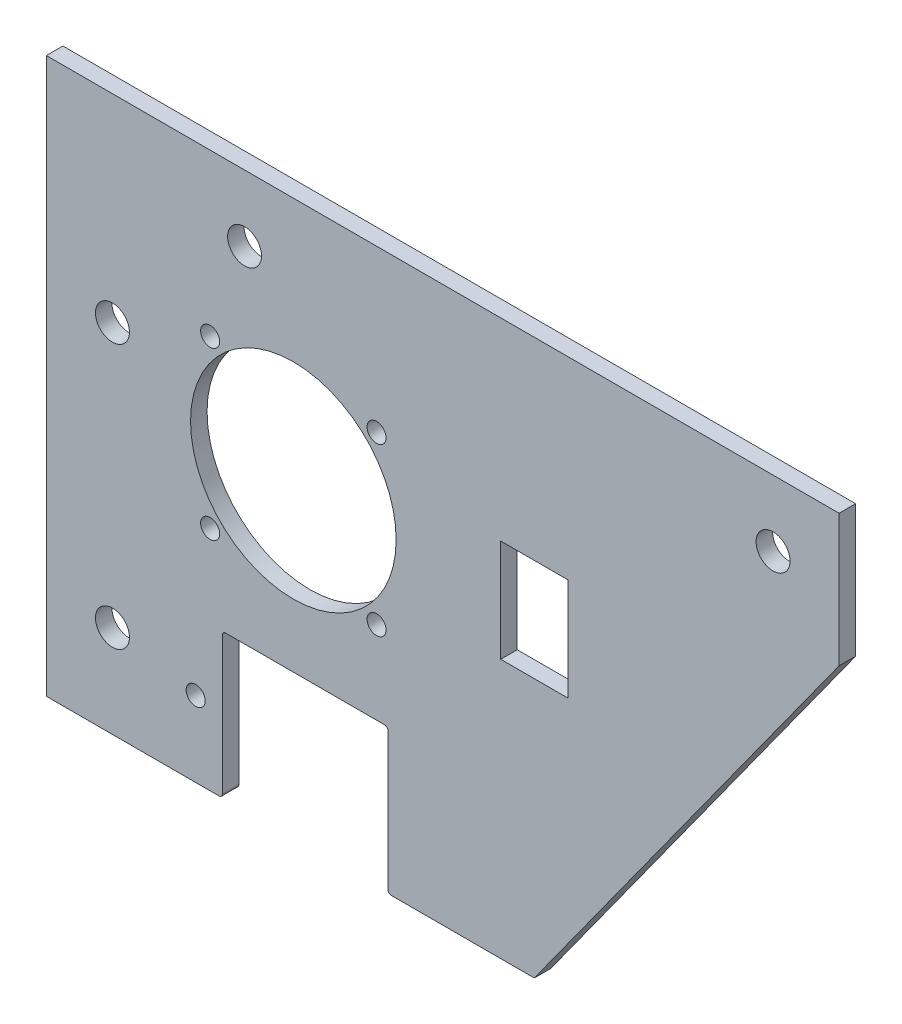
ISO-10303-21;
HEADER;
FILE_DESCRIPTION(('STEP AP214'),'2;1');
FILE_NAME('part.step','',(''),(''),'','','');
FILE_SCHEMA(('AUTOMOTIVE_DESIGN { 1 0 10303 214 1 1 1 1 }'));
ENDSEC;
DATA;
#1=APPLICATION_CONTEXT('core data for automotive mechanical design processes');
#2=APPLICATION_PROTOCOL_DEFINITION('international standard','automotive_design',2000,#1);
#3=PRODUCT_CONTEXT('',#1,'mechanical');
#4=PRODUCT('Part','Part','',(#3));
#5=PRODUCT_RELATED_PRODUCT_CATEGORY('part','',(#4));
#6=PRODUCT_DEFINITION_FORMATION('','',#4);
#7=PRODUCT_DEFINITION_CONTEXT('part definition',#1,'design');
#8=PRODUCT_DEFINITION('design','',#6,#7);
#9=PRODUCT_DEFINITION_SHAPE('','',#8);
#10=(LENGTH_UNIT() NAMED_UNIT(*) SI_UNIT(.MILLI.,.METRE.));
#11=(NAMED_UNIT(*) PLANE_ANGLE_UNIT() SI_UNIT($,.RADIAN.));
#12=(NAMED_UNIT(*) SI_UNIT($,.STERADIAN.) SOLID_ANGLE_UNIT());
#13=UNCERTAINTY_MEASURE_WITH_UNIT(LENGTH_MEASURE(1.E-05),#10,'distance_accuracy_value','');
#14=(GEOMETRIC_REPRESENTATION_CONTEXT(3) GLOBAL_UNCERTAINTY_ASSIGNED_CONTEXT((#13)) GLOBAL_UNIT_ASSIGNED_CONTEXT((#10,
#11,#12)) REPRESENTATION_CONTEXT('',''));
#15=CARTESIAN_POINT('',(0.,0.,0.));
#16=DIRECTION('',(0.,0.,1.));
#17=DIRECTION('',(1.,0.,0.));
#18=AXIS2_PLACEMENT_3D('',#15,#16,#17);
#19=CARTESIAN_POINT('',(0.,0.,3.175));
#20=DIRECTION('',(0.,0.,1.));
#21=DIRECTION('',(1.,0.,0.));
#22=AXIS2_PLACEMENT_3D('',#19,#20,#21);
#23=PLANE('',#22);
#24=CARTESIAN_POINT('',(-34.2,-22.86,3.175));
#25=DIRECTION('',(0.,0.,1.));
#26=DIRECTION('',(1.,0.,0.));
#27=AXIS2_PLACEMENT_3D('',#24,#25,#26);
#28=CIRCLE('',#27,3.26389999999999);
#29=CARTESIAN_POINT('',(-30.9361,-22.86,3.175));
#30=VERTEX_POINT('',#29);
#31=EDGE_CURVE('E562',#30,#30,#28,.T.);
#32=ORIENTED_EDGE('',*,*,#31,.F.);
#33=EDGE_LOOP('',(#32));
#34=FACE_BOUND('',#33,.T.);
#35=CARTESIAN_POINT('',(-8.8,53.34,3.175));
#36=DIRECTION('',(0.,0.,1.));
#37=DIRECTION('',(1.,0.,0.));
#38=AXIS2_PLACEMENT_3D('',#35,#36,#37);
#39=CIRCLE('',#38,3.26389999999999);
#40=CARTESIAN_POINT('',(-5.53610000000001,53.34,3.175));
#41=VERTEX_POINT('',#40);
#42=EDGE_CURVE('E564',#41,#41,#39,.T.);
#43=ORIENTED_EDGE('',*,*,#42,.F.);
#44=EDGE_LOOP('',(#43));
#45=FACE_BOUND('',#44,.T.);
#46=CARTESIAN_POINT('',(92.8,53.34,3.175));
#47=DIRECTION('',(0.,0.,1.));
#48=DIRECTION('',(1.,0.,0.));
#49=AXIS2_PLACEMENT_3D('',#46,#47,#48);
#50=CIRCLE('',#49,3.26389999999999);
#51=CARTESIAN_POINT('',(96.0639,53.34,3.175));
#52=VERTEX_POINT('',#51);
#53=EDGE_CURVE('E572',#52,#52,#50,.T.);
#54=ORIENTED_EDGE('',*,*,#53,.F.);
#55=EDGE_LOOP('',(#54));
#56=FACE_BOUND('',#55,.T.);
#57=CARTESIAN_POINT('',(-34.2,27.94,3.175));
#58=DIRECTION('',(0.,0.,1.));
#59=DIRECTION('',(1.,0.,0.));
#60=AXIS2_PLACEMENT_3D('',#57,#58,#59);
#61=CIRCLE('',#60,3.26389999999999);
#62=CARTESIAN_POINT('',(-30.9361,27.94,3.175));
#63=VERTEX_POINT('',#62);
#64=EDGE_CURVE('E578',#63,#63,#61,.T.);
#65=ORIENTED_EDGE('',*,*,#64,.F.);
#66=EDGE_LOOP('',(#65));
#67=FACE_BOUND('',#66,.T.);
#68=CARTESIAN_POINT('',(-15.42,35.04,3.175));
#69=DIRECTION('',(0.,0.,1.));
#70=DIRECTION('',(1.,0.,0.));
#71=AXIS2_PLACEMENT_3D('',#68,#69,#70);
#72=CIRCLE('',#71,1.82879999999999);
#73=CARTESIAN_POINT('',(-13.5912,35.04,3.175));
#74=VERTEX_POINT('',#73);
#75=EDGE_CURVE('E584',#74,#74,#72,.T.);
#76=ORIENTED_EDGE('',*,*,#75,.F.);
#77=EDGE_LOOP('',(#76));
#78=FACE_BOUND('',#77,.T.);
#79=CARTESIAN_POINT('',(16.58,35.04,3.175));
#80=DIRECTION('',(0.,0.,1.));
#81=DIRECTION('',(1.,0.,0.));
#82=AXIS2_PLACEMENT_3D('',#79,#80,#81);
#83=CIRCLE('',#82,1.82879999999999);
#84=CARTESIAN_POINT('',(18.4088,35.04,3.175));
#85=VERTEX_POINT('',#84);
#86=EDGE_CURVE('E590',#85,#85,#83,.T.);
#87=ORIENTED_EDGE('',*,*,#86,.F.);
#88=EDGE_LOOP('',(#87));
#89=FACE_BOUND('',#88,.T.);
#90=CARTESIAN_POINT('',(16.58,3.04,3.175));
#91=DIRECTION('',(0.,0.,1.));
#92=DIRECTION('',(1.,0.,0.));
#93=AXIS2_PLACEMENT_3D('',#90,#91,#92);
#94=CIRCLE('',#93,1.82879999999999);
#95=CARTESIAN_POINT('',(18.4088,3.04,3.175));
#96=VERTEX_POINT('',#95);
#97=EDGE_CURVE('E596',#96,#96,#94,.T.);
#98=ORIENTED_EDGE('',*,*,#97,.F.);
#99=EDGE_LOOP('',(#98));
#100=FACE_BOUND('',#99,.T.);
#101=CARTESIAN_POINT('',(-15.42,3.03999999999999,3.175));
#102=DIRECTION('',(0.,0.,1.));
#103=DIRECTION('',(1.,0.,0.));
#104=AXIS2_PLACEMENT_3D('',#101,#102,#103);
#105=CIRCLE('',#104,1.82879999999999);
#106=CARTESIAN_POINT('',(-13.5912,3.03999999999999,3.175));
#107=VERTEX_POINT('',#106);
#108=EDGE_CURVE('E602',#107,#107,#105,.T.);
#109=ORIENTED_EDGE('',*,*,#108,.F.);
#110=EDGE_LOOP('',(#109));
#111=FACE_BOUND('',#110,.T.);
#112=CARTESIAN_POINT('',(-18.198,-26.14,3.175));
#113=DIRECTION('',(0.,0.,1.));
#114=DIRECTION('',(1.,0.,0.));
#115=AXIS2_PLACEMENT_3D('',#112,#113,#114);
#116=CIRCLE('',#115,1.82879999999999);
#117=CARTESIAN_POINT('',(-16.3692,-26.14,3.175));
#118=VERTEX_POINT('',#117);
#119=EDGE_CURVE('E608',#118,#118,#116,.T.);
#120=ORIENTED_EDGE('',*,*,#119,.F.);
#121=EDGE_LOOP('',(#120));
#122=FACE_BOUND('',#121,.T.);
#123=DIRECTION('',(-1.,0.,0.));
#124=VECTOR('',#123,1.);
#125=CARTESIAN_POINT('',(40.4484,28.8825,3.175));
#126=LINE('',#125,#124);
#127=CARTESIAN_POINT('',(53.3516,28.8825,3.175));
#128=VERTEX_POINT('',#127);
#129=CARTESIAN_POINT('',(40.4484,28.8825,3.175));
#130=VERTEX_POINT('',#129);
#131=EDGE_CURVE('E164',#128,#130,#126,.T.);
#132=ORIENTED_EDGE('',*,*,#131,.F.);
#133=DIRECTION('',(0.,1.,0.));
#134=VECTOR('',#133,1.);
#135=CARTESIAN_POINT('',(53.3516,9.1975,3.175));
#136=LINE('',#135,#134);
#137=CARTESIAN_POINT('',(53.3516,9.1975,3.175));
#138=VERTEX_POINT('',#137);
#139=EDGE_CURVE('E154',#138,#128,#136,.T.);
#140=ORIENTED_EDGE('',*,*,#139,.F.);
#141=DIRECTION('',(1.,0.,0.));
#142=VECTOR('',#141,1.);
#143=CARTESIAN_POINT('',(40.4484,9.1975,3.175));
#144=LINE('',#143,#142);
#145=CARTESIAN_POINT('',(40.4484,9.1975,3.175));
#146=VERTEX_POINT('',#145);
#147=EDGE_CURVE('E179',#146,#138,#144,.T.);
#148=ORIENTED_EDGE('',*,*,#147,.F.);
#149=DIRECTION('',(0.,-1.,0.));
#150=VECTOR('',#149,1.);
#151=CARTESIAN_POINT('',(40.4484,9.1975,3.175));
#152=LINE('',#151,#150);
#153=EDGE_CURVE('E177',#130,#146,#152,.T.);
#154=ORIENTED_EDGE('',*,*,#153,.F.);
#155=EDGE_LOOP('',(#132,#140,#148,#154));
#156=FACE_BOUND('',#155,.T.);
#157=DIRECTION('',(1.,0.,0.));
#158=VECTOR('',#157,1.);
#159=CARTESIAN_POINT('',(-46.9,-40.64,3.175));
#160=LINE('',#159,#158);
#161=CARTESIAN_POINT('',(-46.9,-40.64,3.175));
#162=VERTEX_POINT('',#161);
#163=CARTESIAN_POINT('',(-13.697,-40.64,3.175));
#164=VERTEX_POINT('',#163);
#165=EDGE_CURVE('E200',#162,#164,#160,.T.);
#166=ORIENTED_EDGE('',*,*,#165,.T.);
#167=CARTESIAN_POINT('',(-13.697,-40.005,3.175));
#168=DIRECTION('',(0.,0.,1.));
#169=DIRECTION('',(1.,0.,0.));
#170=AXIS2_PLACEMENT_3D('',#167,#168,#169);
#171=CIRCLE('',#170,0.635);
#172=CARTESIAN_POINT('',(-13.062,-40.005,3.175));
#173=VERTEX_POINT('',#172);
#174=EDGE_CURVE('E267',#164,#173,#171,.T.);
#175=ORIENTED_EDGE('',*,*,#174,.T.);
#176=DIRECTION('',(0.,1.,0.));
#177=VECTOR('',#176,1.);
#178=CARTESIAN_POINT('',(-13.062,-40.64,3.175));
#179=LINE('',#178,#177);
#180=CARTESIAN_POINT('',(-13.062,-13.513,3.175));
#181=VERTEX_POINT('',#180);
#182=EDGE_CURVE('E204',#173,#181,#179,.T.);
#183=ORIENTED_EDGE('',*,*,#182,.T.);
#184=CARTESIAN_POINT('',(-12.427,-13.513,3.175));
#185=DIRECTION('',(0.,0.,1.));
#186=DIRECTION('',(1.,0.,0.));
#187=AXIS2_PLACEMENT_3D('',#184,#185,#186);
#188=CIRCLE('',#187,0.635);
#189=CARTESIAN_POINT('',(-12.427,-12.878,3.175));
#190=VERTEX_POINT('',#189);
#191=EDGE_CURVE('E11',#181,#190,#188,.F.);
#192=ORIENTED_EDGE('',*,*,#191,.T.);
#193=DIRECTION('',(1.,0.,0.));
#194=VECTOR('',#193,1.);
#195=CARTESIAN_POINT('',(-13.062,-12.878,3.175));
#196=LINE('',#195,#194);
#197=CARTESIAN_POINT('',(18.127,-12.878,3.175));
#198=VERTEX_POINT('',#197);
#199=EDGE_CURVE('E207',#190,#198,#196,.T.);
#200=ORIENTED_EDGE('',*,*,#199,.T.);
#201=CARTESIAN_POINT('',(18.127,-13.513,3.175));
#202=DIRECTION('',(0.,0.,1.));
#203=DIRECTION('',(1.,0.,0.));
#204=AXIS2_PLACEMENT_3D('',#201,#202,#203);
#205=CIRCLE('',#204,0.635);
#206=CARTESIAN_POINT('',(18.762,-13.513,3.175));
#207=VERTEX_POINT('',#206);
#208=EDGE_CURVE('E283',#198,#207,#205,.F.);
#209=ORIENTED_EDGE('',*,*,#208,.T.);
#210=DIRECTION('',(0.,-1.,0.));
#211=VECTOR('',#210,1.);
#212=CARTESIAN_POINT('',(18.762,-12.878,3.175));
#213=LINE('',#212,#211);
#214=CARTESIAN_POINT('',(18.762,-40.005,3.175));
#215=VERTEX_POINT('',#214);
#216=EDGE_CURVE('E210',#207,#215,#213,.T.);
#217=ORIENTED_EDGE('',*,*,#216,.T.);
#218=CARTESIAN_POINT('',(19.397,-40.005,3.175));
#219=DIRECTION('',(0.,0.,1.));
#220=DIRECTION('',(1.,0.,0.));
#221=AXIS2_PLACEMENT_3D('',#218,#219,#220);
#222=CIRCLE('',#221,0.635);
#223=CARTESIAN_POINT('',(19.397,-40.64,3.175));
#224=VERTEX_POINT('',#223);
#225=EDGE_CURVE('E48',#215,#224,#222,.T.);
#226=ORIENTED_EDGE('',*,*,#225,.T.);
#227=DIRECTION('',(1.,0.,0.));
#228=VECTOR('',#227,1.);
#229=CARTESIAN_POINT('',(18.762,-40.64,3.175));
#230=LINE('',#229,#228);
#231=CARTESIAN_POINT('',(46.9,-40.64,3.175));
#232=VERTEX_POINT('',#231);
#233=EDGE_CURVE('E212',#224,#232,#230,.T.);
#234=ORIENTED_EDGE('',*,*,#233,.T.);
#235=DIRECTION('',(0.584819901236344,0.811163166766042,0.));
#236=VECTOR('',#235,1.);
#237=CARTESIAN_POINT('',(46.9,-40.64,3.175));
#238=LINE('',#237,#236);
#239=CARTESIAN_POINT('',(105.5,40.64,3.175));
#240=VERTEX_POINT('',#239);
#241=EDGE_CURVE('E214',#232,#240,#238,.T.);
#242=ORIENTED_EDGE('',*,*,#241,.T.);
#243=DIRECTION('',(0.,1.,0.));
#244=VECTOR('',#243,1.);
#245=CARTESIAN_POINT('',(105.5,40.64,3.175));
#246=LINE('',#245,#244);
#247=CARTESIAN_POINT('',(105.5,66.04,3.175));
#248=VERTEX_POINT('',#247);
#249=EDGE_CURVE('E216',#240,#248,#246,.T.);
#250=ORIENTED_EDGE('',*,*,#249,.T.);
#251=DIRECTION('',(-1.,0.,0.));
#252=VECTOR('',#251,1.);
#253=CARTESIAN_POINT('',(105.5,66.04,3.175));
#254=LINE('',#253,#252);
#255=CARTESIAN_POINT('',(-46.9,66.04,3.175));
#256=VERTEX_POINT('',#255);
#257=EDGE_CURVE('E218',#248,#256,#254,.T.);
#258=ORIENTED_EDGE('',*,*,#257,.T.);
#259=DIRECTION('',(0.,-1.,0.));
#260=VECTOR('',#259,1.);
#261=CARTESIAN_POINT('',(-46.9,66.04,3.175));
#262=LINE('',#261,#260);
#263=EDGE_CURVE('E197',#256,#162,#262,.T.);
#264=ORIENTED_EDGE('',*,*,#263,.T.);
#265=EDGE_LOOP('',(#166,#175,#183,#192,#200,#209,#217,#226,#234,#242,#250,#258,#264));
#266=FACE_BOUND('',#265,.T.);
#267=CARTESIAN_POINT('',(0.579999999999997,19.04,3.175));
#268=DIRECTION('',(0.,0.,1.));
#269=DIRECTION('',(1.,0.,0.));
#270=AXIS2_PLACEMENT_3D('',#267,#268,#269);
#271=CIRCLE('',#270,19.762);
#272=CARTESIAN_POINT('',(20.342,19.04,3.175));
#273=VERTEX_POINT('',#272);
#274=EDGE_CURVE('E186',#273,#273,#271,.T.);
#275=ORIENTED_EDGE('',*,*,#274,.F.);
#276=EDGE_LOOP('',(#275));
#277=FACE_BOUND('',#276,.T.);
#278=ADVANCED_FACE('F33',(#34,#45,#56,#67,#78,#89,#100,#111,#122,#156,#266,#277),#23,.T.);
#279=CARTESIAN_POINT('',(0.,0.,0.));
#280=DIRECTION('',(0.,0.,1.));
#281=DIRECTION('',(1.,0.,0.));
#282=AXIS2_PLACEMENT_3D('',#279,#280,#281);
#283=PLANE('',#282);
#284=CARTESIAN_POINT('',(-34.2,-22.86,0.));
#285=DIRECTION('',(0.,0.,1.));
#286=DIRECTION('',(1.,0.,0.));
#287=AXIS2_PLACEMENT_3D('',#284,#285,#286);
#288=CIRCLE('',#287,3.2639);
#289=CARTESIAN_POINT('',(-30.9361,-22.86,0.));
#290=VERTEX_POINT('',#289);
#291=EDGE_CURVE('E560',#290,#290,#288,.T.);
#292=ORIENTED_EDGE('',*,*,#291,.T.);
#293=EDGE_LOOP('',(#292));
#294=FACE_BOUND('',#293,.T.);
#295=CARTESIAN_POINT('',(-8.8,53.34,0.));
#296=DIRECTION('',(0.,0.,1.));
#297=DIRECTION('',(1.,0.,0.));
#298=AXIS2_PLACEMENT_3D('',#295,#296,#297);
#299=CIRCLE('',#298,3.2639);
#300=CARTESIAN_POINT('',(-5.5361,53.34,0.));
#301=VERTEX_POINT('',#300);
#302=EDGE_CURVE('E569',#301,#301,#299,.T.);
#303=ORIENTED_EDGE('',*,*,#302,.T.);
#304=EDGE_LOOP('',(#303));
#305=FACE_BOUND('',#304,.T.);
#306=CARTESIAN_POINT('',(92.8,53.34,0.));
#307=DIRECTION('',(0.,0.,1.));
#308=DIRECTION('',(1.,0.,0.));
#309=AXIS2_PLACEMENT_3D('',#306,#307,#308);
#310=CIRCLE('',#309,3.2639);
#311=CARTESIAN_POINT('',(96.0639,53.34,0.));
#312=VERTEX_POINT('',#311);
#313=EDGE_CURVE('E575',#312,#312,#310,.T.);
#314=ORIENTED_EDGE('',*,*,#313,.T.);
#315=EDGE_LOOP('',(#314));
#316=FACE_BOUND('',#315,.T.);
#317=CARTESIAN_POINT('',(-34.2,27.94,0.));
#318=DIRECTION('',(0.,0.,1.));
#319=DIRECTION('',(1.,0.,0.));
#320=AXIS2_PLACEMENT_3D('',#317,#318,#319);
#321=CIRCLE('',#320,3.2639);
#322=CARTESIAN_POINT('',(-30.9361,27.94,0.));
#323=VERTEX_POINT('',#322);
#324=EDGE_CURVE('E581',#323,#323,#321,.T.);
#325=ORIENTED_EDGE('',*,*,#324,.T.);
#326=EDGE_LOOP('',(#325));
#327=FACE_BOUND('',#326,.T.);
#328=CARTESIAN_POINT('',(-15.42,35.04,0.));
#329=DIRECTION('',(0.,0.,1.));
#330=DIRECTION('',(1.,0.,0.));
#331=AXIS2_PLACEMENT_3D('',#328,#329,#330);
#332=CIRCLE('',#331,1.8288);
#333=CARTESIAN_POINT('',(-13.5912,35.04,0.));
#334=VERTEX_POINT('',#333);
#335=EDGE_CURVE('E587',#334,#334,#332,.T.);
#336=ORIENTED_EDGE('',*,*,#335,.T.);
#337=EDGE_LOOP('',(#336));
#338=FACE_BOUND('',#337,.T.);
#339=CARTESIAN_POINT('',(16.58,35.04,0.));
#340=DIRECTION('',(0.,0.,1.));
#341=DIRECTION('',(1.,0.,0.));
#342=AXIS2_PLACEMENT_3D('',#339,#340,#341);
#343=CIRCLE('',#342,1.8288);
#344=CARTESIAN_POINT('',(18.4088,35.04,0.));
#345=VERTEX_POINT('',#344);
#346=EDGE_CURVE('E593',#345,#345,#343,.T.);
#347=ORIENTED_EDGE('',*,*,#346,.T.);
#348=EDGE_LOOP('',(#347));
#349=FACE_BOUND('',#348,.T.);
#350=CARTESIAN_POINT('',(16.58,3.04,0.));
#351=DIRECTION('',(0.,0.,1.));
#352=DIRECTION('',(1.,0.,0.));
#353=AXIS2_PLACEMENT_3D('',#350,#351,#352);
#354=CIRCLE('',#353,1.8288);
#355=CARTESIAN_POINT('',(18.4088,3.04,0.));
#356=VERTEX_POINT('',#355);
#357=EDGE_CURVE('E599',#356,#356,#354,.T.);
#358=ORIENTED_EDGE('',*,*,#357,.T.);
#359=EDGE_LOOP('',(#358));
#360=FACE_BOUND('',#359,.T.);
#361=CARTESIAN_POINT('',(-15.42,3.03999999999999,0.));
#362=DIRECTION('',(0.,0.,1.));
#363=DIRECTION('',(1.,0.,0.));
#364=AXIS2_PLACEMENT_3D('',#361,#362,#363);
#365=CIRCLE('',#364,1.8288);
#366=CARTESIAN_POINT('',(-13.5912,3.03999999999999,0.));
#367=VERTEX_POINT('',#366);
#368=EDGE_CURVE('E605',#367,#367,#365,.T.);
#369=ORIENTED_EDGE('',*,*,#368,.T.);
#370=EDGE_LOOP('',(#369));
#371=FACE_BOUND('',#370,.T.);
#372=CARTESIAN_POINT('',(-18.198,-26.14,0.));
#373=DIRECTION('',(0.,0.,1.));
#374=DIRECTION('',(1.,0.,0.));
#375=AXIS2_PLACEMENT_3D('',#372,#373,#374);
#376=CIRCLE('',#375,1.8288);
#377=CARTESIAN_POINT('',(-16.3692,-26.14,0.));
#378=VERTEX_POINT('',#377);
#379=EDGE_CURVE('E611',#378,#378,#376,.T.);
#380=ORIENTED_EDGE('',*,*,#379,.T.);
#381=EDGE_LOOP('',(#380));
#382=FACE_BOUND('',#381,.T.);
#383=DIRECTION('',(0.,1.,0.));
#384=VECTOR('',#383,1.);
#385=CARTESIAN_POINT('',(53.3516,9.1975,0.));
#386=LINE('',#385,#384);
#387=CARTESIAN_POINT('',(53.3516,9.1975,0.));
#388=VERTEX_POINT('',#387);
#389=CARTESIAN_POINT('',(53.3516,28.8825,0.));
#390=VERTEX_POINT('',#389);
#391=EDGE_CURVE('E184',#388,#390,#386,.T.);
#392=ORIENTED_EDGE('',*,*,#391,.T.);
#393=DIRECTION('',(-1.,0.,0.));
#394=VECTOR('',#393,1.);
#395=CARTESIAN_POINT('',(40.4484,28.8825,0.));
#396=LINE('',#395,#394);
#397=CARTESIAN_POINT('',(40.4484,28.8825,0.));
#398=VERTEX_POINT('',#397);
#399=EDGE_CURVE('E171',#390,#398,#396,.T.);
#400=ORIENTED_EDGE('',*,*,#399,.T.);
#401=DIRECTION('',(0.,-1.,0.));
#402=VECTOR('',#401,1.);
#403=CARTESIAN_POINT('',(40.4484,9.1975,0.));
#404=LINE('',#403,#402);
#405=CARTESIAN_POINT('',(40.4484,9.1975,0.));
#406=VERTEX_POINT('',#405);
#407=EDGE_CURVE('E188',#398,#406,#404,.T.);
#408=ORIENTED_EDGE('',*,*,#407,.T.);
#409=DIRECTION('',(1.,0.,0.));
#410=VECTOR('',#409,1.);
#411=CARTESIAN_POINT('',(40.4484,9.1975,0.));
#412=LINE('',#411,#410);
#413=EDGE_CURVE('E165',#406,#388,#412,.T.);
#414=ORIENTED_EDGE('',*,*,#413,.T.);
#415=EDGE_LOOP('',(#392,#400,#408,#414));
#416=FACE_BOUND('',#415,.T.);
#417=DIRECTION('',(0.,1.,0.));
#418=VECTOR('',#417,1.);
#419=CARTESIAN_POINT('',(-13.062,-40.64,0.));
#420=LINE('',#419,#418);
#421=CARTESIAN_POINT('',(-13.062,-40.005,0.));
#422=VERTEX_POINT('',#421);
#423=CARTESIAN_POINT('',(-13.062,-13.513,0.));
#424=VERTEX_POINT('',#423);
#425=EDGE_CURVE('E226',#422,#424,#420,.T.);
#426=ORIENTED_EDGE('',*,*,#425,.F.);
#427=CARTESIAN_POINT('',(-13.697,-40.005,0.));
#428=DIRECTION('',(0.,0.,1.));
#429=DIRECTION('',(1.,0.,0.));
#430=AXIS2_PLACEMENT_3D('',#427,#428,#429);
#431=CIRCLE('',#430,0.635);
#432=CARTESIAN_POINT('',(-13.697,-40.64,0.));
#433=VERTEX_POINT('',#432);
#434=EDGE_CURVE('E262',#422,#433,#431,.F.);
#435=ORIENTED_EDGE('',*,*,#434,.T.);
#436=DIRECTION('',(1.,0.,0.));
#437=VECTOR('',#436,1.);
#438=CARTESIAN_POINT('',(-46.9,-40.64,0.));
#439=LINE('',#438,#437);
#440=CARTESIAN_POINT('',(-46.9,-40.64,0.));
#441=VERTEX_POINT('',#440);
#442=EDGE_CURVE('E223',#441,#433,#439,.T.);
#443=ORIENTED_EDGE('',*,*,#442,.F.);
#444=DIRECTION('',(0.,-1.,0.));
#445=VECTOR('',#444,1.);
#446=CARTESIAN_POINT('',(-46.9,66.04,0.));
#447=LINE('',#446,#445);
#448=CARTESIAN_POINT('',(-46.9,66.04,0.));
#449=VERTEX_POINT('',#448);
#450=EDGE_CURVE('E172',#449,#441,#447,.T.);
#451=ORIENTED_EDGE('',*,*,#450,.F.);
#452=DIRECTION('',(-1.,0.,0.));
#453=VECTOR('',#452,1.);
#454=CARTESIAN_POINT('',(105.5,66.04,0.));
#455=LINE('',#454,#453);
#456=CARTESIAN_POINT('',(105.5,66.04,0.));
#457=VERTEX_POINT('',#456);
#458=EDGE_CURVE('E201',#457,#449,#455,.T.);
#459=ORIENTED_EDGE('',*,*,#458,.F.);
#460=DIRECTION('',(0.,1.,0.));
#461=VECTOR('',#460,1.);
#462=CARTESIAN_POINT('',(105.5,40.64,0.));
#463=LINE('',#462,#461);
#464=CARTESIAN_POINT('',(105.5,40.64,0.));
#465=VERTEX_POINT('',#464);
#466=EDGE_CURVE('E238',#465,#457,#463,.T.);
#467=ORIENTED_EDGE('',*,*,#466,.F.);
#468=DIRECTION('',(0.584819901236344,0.811163166766042,0.));
#469=VECTOR('',#468,1.);
#470=CARTESIAN_POINT('',(46.9,-40.64,0.));
#471=LINE('',#470,#469);
#472=CARTESIAN_POINT('',(46.9,-40.64,0.));
#473=VERTEX_POINT('',#472);
#474=EDGE_CURVE('E236',#473,#465,#471,.T.);
#475=ORIENTED_EDGE('',*,*,#474,.F.);
#476=DIRECTION('',(1.,0.,0.));
#477=VECTOR('',#476,1.);
#478=CARTESIAN_POINT('',(18.762,-40.64,0.));
#479=LINE('',#478,#477);
#480=CARTESIAN_POINT('',(19.397,-40.64,0.));
#481=VERTEX_POINT('',#480);
#482=EDGE_CURVE('E234',#481,#473,#479,.T.);
#483=ORIENTED_EDGE('',*,*,#482,.F.);
#484=CARTESIAN_POINT('',(19.397,-40.005,0.));
#485=DIRECTION('',(0.,0.,1.));
#486=DIRECTION('',(1.,0.,0.));
#487=AXIS2_PLACEMENT_3D('',#484,#485,#486);
#488=CIRCLE('',#487,0.635);
#489=CARTESIAN_POINT('',(18.762,-40.005,0.));
#490=VERTEX_POINT('',#489);
#491=EDGE_CURVE('E260',#481,#490,#488,.F.);
#492=ORIENTED_EDGE('',*,*,#491,.T.);
#493=DIRECTION('',(0.,-1.,0.));
#494=VECTOR('',#493,1.);
#495=CARTESIAN_POINT('',(18.762,-12.878,0.));
#496=LINE('',#495,#494);
#497=CARTESIAN_POINT('',(18.762,-13.513,0.));
#498=VERTEX_POINT('',#497);
#499=EDGE_CURVE('E232',#498,#490,#496,.T.);
#500=ORIENTED_EDGE('',*,*,#499,.F.);
#501=CARTESIAN_POINT('',(18.127,-13.513,0.));
#502=DIRECTION('',(0.,0.,1.));
#503=DIRECTION('',(1.,0.,0.));
#504=AXIS2_PLACEMENT_3D('',#501,#502,#503);
#505=CIRCLE('',#504,0.635);
#506=CARTESIAN_POINT('',(18.127,-12.878,0.));
#507=VERTEX_POINT('',#506);
#508=EDGE_CURVE('E281',#498,#507,#505,.T.);
#509=ORIENTED_EDGE('',*,*,#508,.T.);
#510=DIRECTION('',(1.,0.,0.));
#511=VECTOR('',#510,1.);
#512=CARTESIAN_POINT('',(-13.062,-12.878,0.));
#513=LINE('',#512,#511);
#514=CARTESIAN_POINT('',(-12.427,-12.878,0.));
#515=VERTEX_POINT('',#514);
#516=EDGE_CURVE('E229',#515,#507,#513,.T.);
#517=ORIENTED_EDGE('',*,*,#516,.F.);
#518=CARTESIAN_POINT('',(-12.427,-13.513,0.));
#519=DIRECTION('',(0.,0.,1.));
#520=DIRECTION('',(1.,0.,0.));
#521=AXIS2_PLACEMENT_3D('',#518,#519,#520);
#522=CIRCLE('',#521,0.635);
#523=EDGE_CURVE('E41',#515,#424,#522,.T.);
#524=ORIENTED_EDGE('',*,*,#523,.T.);
#525=EDGE_LOOP('',(#426,#435,#443,#451,#459,#467,#475,#483,#492,#500,#509,#517,#524));
#526=FACE_BOUND('',#525,.T.);
#527=CARTESIAN_POINT('',(0.579999999999997,19.04,0.));
#528=DIRECTION('',(0.,0.,1.));
#529=DIRECTION('',(1.,0.,0.));
#530=AXIS2_PLACEMENT_3D('',#527,#528,#529);
#531=CIRCLE('',#530,19.762);
#532=CARTESIAN_POINT('',(20.342,19.04,0.));
#533=VERTEX_POINT('',#532);
#534=EDGE_CURVE('E614',#533,#533,#531,.T.);
#535=ORIENTED_EDGE('',*,*,#534,.T.);
#536=EDGE_LOOP('',(#535));
#537=FACE_BOUND('',#536,.T.);
#538=ADVANCED_FACE('F287',(#294,#305,#316,#327,#338,#349,#360,#371,#382,#416,#526,#537),#283,.F.);
#539=CARTESIAN_POINT('',(-46.9,66.04,3.175));
#540=DIRECTION('',(1.,0.,0.));
#541=DIRECTION('',(0.,1.,0.));
#542=AXIS2_PLACEMENT_3D('',#539,#540,#541);
#543=PLANE('',#542);
#544=ORIENTED_EDGE('',*,*,#450,.T.);
#545=DIRECTION('',(0.,0.,-1.));
#546=VECTOR('',#545,1.);
#547=CARTESIAN_POINT('',(-46.9,-40.64,3.175));
#548=LINE('',#547,#546);
#549=EDGE_CURVE('E252',#162,#441,#548,.T.);
#550=ORIENTED_EDGE('',*,*,#549,.F.);
#551=ORIENTED_EDGE('',*,*,#263,.F.);
#552=DIRECTION('',(0.,0.,-1.));
#553=VECTOR('',#552,1.);
#554=CARTESIAN_POINT('',(-46.9,66.04,3.175));
#555=LINE('',#554,#553);
#556=EDGE_CURVE('E220',#256,#449,#555,.T.);
#557=ORIENTED_EDGE('',*,*,#556,.T.);
#558=EDGE_LOOP('',(#544,#550,#551,#557));
#559=FACE_BOUND('',#558,.T.);
#560=ADVANCED_FACE('F334',(#559),#543,.F.);
#561=CARTESIAN_POINT('',(-46.9,-40.64,3.175));
#562=DIRECTION('',(0.,1.,0.));
#563=DIRECTION('',(0.,0.,1.));
#564=AXIS2_PLACEMENT_3D('',#561,#562,#563);
#565=PLANE('',#564);
#566=ORIENTED_EDGE('',*,*,#442,.T.);
#567=DIRECTION('',(0.,0.,-1.));
#568=VECTOR('',#567,1.);
#569=CARTESIAN_POINT('',(-13.697,-40.64,3.175));
#570=LINE('',#569,#568);
#571=EDGE_CURVE('E264',#433,#164,#570,.F.);
#572=ORIENTED_EDGE('',*,*,#571,.T.);
#573=ORIENTED_EDGE('',*,*,#165,.F.);
#574=ORIENTED_EDGE('',*,*,#549,.T.);
#575=EDGE_LOOP('',(#566,#572,#573,#574));
#576=FACE_BOUND('',#575,.T.);
#577=ADVANCED_FACE('F337',(#576),#565,.F.);
#578=CARTESIAN_POINT('',(-13.062,-40.64,3.175));
#579=DIRECTION('',(-1.,0.,0.));
#580=DIRECTION('',(0.,-1.,0.));
#581=AXIS2_PLACEMENT_3D('',#578,#579,#580);
#582=PLANE('',#581);
#583=ORIENTED_EDGE('',*,*,#182,.F.);
#584=DIRECTION('',(0.,0.,-1.));
#585=VECTOR('',#584,1.);
#586=CARTESIAN_POINT('',(-13.062,-40.005,3.175));
#587=LINE('',#586,#585);
#588=EDGE_CURVE('E257',#173,#422,#587,.T.);
#589=ORIENTED_EDGE('',*,*,#588,.T.);
#590=ORIENTED_EDGE('',*,*,#425,.T.);
#591=DIRECTION('',(0.,0.,-1.));
#592=VECTOR('',#591,1.);
#593=CARTESIAN_POINT('',(-13.062,-13.513,3.175));
#594=LINE('',#593,#592);
#595=EDGE_CURVE('E255',#424,#181,#594,.F.);
#596=ORIENTED_EDGE('',*,*,#595,.T.);
#597=EDGE_LOOP('',(#583,#589,#590,#596));
#598=FACE_BOUND('',#597,.T.);
#599=ADVANCED_FACE('F294',(#598),#582,.F.);
#600=CARTESIAN_POINT('',(-13.062,-12.878,3.175));
#601=DIRECTION('',(0.,1.,0.));
#602=DIRECTION('',(0.,0.,1.));
#603=AXIS2_PLACEMENT_3D('',#600,#601,#602);
#604=PLANE('',#603);
#605=ORIENTED_EDGE('',*,*,#516,.T.);
#606=DIRECTION('',(0.,0.,-1.));
#607=VECTOR('',#606,1.);
#608=CARTESIAN_POINT('',(18.127,-12.878,3.175));
#609=LINE('',#608,#607);
#610=EDGE_CURVE('E279',#507,#198,#609,.F.);
#611=ORIENTED_EDGE('',*,*,#610,.T.);
#612=ORIENTED_EDGE('',*,*,#199,.F.);
#613=DIRECTION('',(0.,0.,-1.));
#614=VECTOR('',#613,1.);
#615=CARTESIAN_POINT('',(-12.427,-12.878,0.));
#616=LINE('',#615,#614);
#617=EDGE_CURVE('E276',#190,#515,#616,.T.);
#618=ORIENTED_EDGE('',*,*,#617,.T.);
#619=EDGE_LOOP('',(#605,#611,#612,#618));
#620=FACE_BOUND('',#619,.T.);
#621=ADVANCED_FACE('F301',(#620),#604,.F.);
#622=CARTESIAN_POINT('',(18.762,-12.878,3.175));
#623=DIRECTION('',(1.,0.,0.));
#624=DIRECTION('',(0.,1.,0.));
#625=AXIS2_PLACEMENT_3D('',#622,#623,#624);
#626=PLANE('',#625);
#627=ORIENTED_EDGE('',*,*,#499,.T.);
#628=DIRECTION('',(0.,0.,-1.));
#629=VECTOR('',#628,1.);
#630=CARTESIAN_POINT('',(18.762,-40.005,3.175));
#631=LINE('',#630,#629);
#632=EDGE_CURVE('E56',#490,#215,#631,.F.);
#633=ORIENTED_EDGE('',*,*,#632,.T.);
#634=ORIENTED_EDGE('',*,*,#216,.F.);
#635=DIRECTION('',(0.,0.,-1.));
#636=VECTOR('',#635,1.);
#637=CARTESIAN_POINT('',(18.762,-13.513,0.));
#638=LINE('',#637,#636);
#639=EDGE_CURVE('E272',#207,#498,#638,.T.);
#640=ORIENTED_EDGE('',*,*,#639,.T.);
#641=EDGE_LOOP('',(#627,#633,#634,#640));
#642=FACE_BOUND('',#641,.T.);
#643=ADVANCED_FACE('F306',(#642),#626,.F.);
#644=CARTESIAN_POINT('',(18.762,-40.64,3.175));
#645=DIRECTION('',(0.,1.,0.));
#646=DIRECTION('',(0.,0.,1.));
#647=AXIS2_PLACEMENT_3D('',#644,#645,#646);
#648=PLANE('',#647);
#649=ORIENTED_EDGE('',*,*,#233,.F.);
#650=DIRECTION('',(0.,0.,-1.));
#651=VECTOR('',#650,1.);
#652=CARTESIAN_POINT('',(19.397,-40.64,3.175));
#653=LINE('',#652,#651);
#654=EDGE_CURVE('E269',#224,#481,#653,.T.);
#655=ORIENTED_EDGE('',*,*,#654,.T.);
#656=ORIENTED_EDGE('',*,*,#482,.T.);
#657=DIRECTION('',(0.,0.,-1.));
#658=VECTOR('',#657,1.);
#659=CARTESIAN_POINT('',(46.9,-40.64,3.175));
#660=LINE('',#659,#658);
#661=EDGE_CURVE('E249',#232,#473,#660,.T.);
#662=ORIENTED_EDGE('',*,*,#661,.F.);
#663=EDGE_LOOP('',(#649,#655,#656,#662));
#664=FACE_BOUND('',#663,.T.);
#665=ADVANCED_FACE('F314',(#664),#648,.F.);
#666=CARTESIAN_POINT('',(46.9,-40.64,3.175));
#667=DIRECTION('',(-0.811163166766042,0.584819901236344,0.));
#668=DIRECTION('',(-0.584819901236344,-0.811163166766042,0.));
#669=AXIS2_PLACEMENT_3D('',#666,#667,#668);
#670=PLANE('',#669);
#671=ORIENTED_EDGE('',*,*,#474,.T.);
#672=DIRECTION('',(0.,0.,-1.));
#673=VECTOR('',#672,1.);
#674=CARTESIAN_POINT('',(105.5,40.64,3.175));
#675=LINE('',#674,#673);
#676=EDGE_CURVE('E246',#240,#465,#675,.T.);
#677=ORIENTED_EDGE('',*,*,#676,.F.);
#678=ORIENTED_EDGE('',*,*,#241,.F.);
#679=ORIENTED_EDGE('',*,*,#661,.T.);
#680=EDGE_LOOP('',(#671,#677,#678,#679));
#681=FACE_BOUND('',#680,.T.);
#682=ADVANCED_FACE('F321',(#681),#670,.F.);
#683=CARTESIAN_POINT('',(105.5,40.64,3.175));
#684=DIRECTION('',(-1.,0.,0.));
#685=DIRECTION('',(0.,-1.,0.));
#686=AXIS2_PLACEMENT_3D('',#683,#684,#685);
#687=PLANE('',#686);
#688=ORIENTED_EDGE('',*,*,#466,.T.);
#689=DIRECTION('',(0.,0.,-1.));
#690=VECTOR('',#689,1.);
#691=CARTESIAN_POINT('',(105.5,66.04,3.175));
#692=LINE('',#691,#690);
#693=EDGE_CURVE('E243',#248,#457,#692,.T.);
#694=ORIENTED_EDGE('',*,*,#693,.F.);
#695=ORIENTED_EDGE('',*,*,#249,.F.);
#696=ORIENTED_EDGE('',*,*,#676,.T.);
#697=EDGE_LOOP('',(#688,#694,#695,#696));
#698=FACE_BOUND('',#697,.T.);
#699=ADVANCED_FACE('F324',(#698),#687,.F.);
#700=CARTESIAN_POINT('',(105.5,66.04,3.175));
#701=DIRECTION('',(0.,-1.,0.));
#702=DIRECTION('',(1.,0.,0.));
#703=AXIS2_PLACEMENT_3D('',#700,#701,#702);
#704=PLANE('',#703);
#705=ORIENTED_EDGE('',*,*,#458,.T.);
#706=ORIENTED_EDGE('',*,*,#556,.F.);
#707=ORIENTED_EDGE('',*,*,#257,.F.);
#708=ORIENTED_EDGE('',*,*,#693,.T.);
#709=EDGE_LOOP('',(#705,#706,#707,#708));
#710=FACE_BOUND('',#709,.T.);
#711=ADVANCED_FACE('F329',(#710),#704,.F.);
#712=CARTESIAN_POINT('',(53.3516,9.1975,3.175));
#713=DIRECTION('',(-1.,0.,0.));
#714=DIRECTION('',(0.,0.,1.));
#715=AXIS2_PLACEMENT_3D('',#712,#713,#714);
#716=PLANE('',#715);
#717=ORIENTED_EDGE('',*,*,#391,.F.);
#718=DIRECTION('',(0.,0.,-1.));
#719=VECTOR('',#718,1.);
#720=CARTESIAN_POINT('',(53.3516,9.1975,3.175));
#721=LINE('',#720,#719);
#722=EDGE_CURVE('E160',#138,#388,#721,.T.);
#723=ORIENTED_EDGE('',*,*,#722,.F.);
#724=ORIENTED_EDGE('',*,*,#139,.T.);
#725=DIRECTION('',(0.,0.,-1.));
#726=VECTOR('',#725,1.);
#727=CARTESIAN_POINT('',(53.3516,28.8825,3.175));
#728=LINE('',#727,#726);
#729=EDGE_CURVE('E157',#128,#390,#728,.T.);
#730=ORIENTED_EDGE('',*,*,#729,.T.);
#731=EDGE_LOOP('',(#717,#723,#724,#730));
#732=FACE_BOUND('',#731,.T.);
#733=ADVANCED_FACE('F156',(#732),#716,.T.);
#734=CARTESIAN_POINT('',(40.4484,28.8825,3.175));
#735=DIRECTION('',(0.,-1.,0.));
#736=DIRECTION('',(0.,0.,-1.));
#737=AXIS2_PLACEMENT_3D('',#734,#735,#736);
#738=PLANE('',#737);
#739=ORIENTED_EDGE('',*,*,#399,.F.);
#740=ORIENTED_EDGE('',*,*,#729,.F.);
#741=ORIENTED_EDGE('',*,*,#131,.T.);
#742=DIRECTION('',(0.,0.,-1.));
#743=VECTOR('',#742,1.);
#744=CARTESIAN_POINT('',(40.4484,28.8825,3.175));
#745=LINE('',#744,#743);
#746=EDGE_CURVE('E173',#130,#398,#745,.T.);
#747=ORIENTED_EDGE('',*,*,#746,.T.);
#748=EDGE_LOOP('',(#739,#740,#741,#747));
#749=FACE_BOUND('',#748,.T.);
#750=ADVANCED_FACE('F168',(#749),#738,.T.);
#751=CARTESIAN_POINT('',(40.4484,9.1975,3.175));
#752=DIRECTION('',(1.,0.,0.));
#753=DIRECTION('',(0.,0.,-1.));
#754=AXIS2_PLACEMENT_3D('',#751,#752,#753);
#755=PLANE('',#754);
#756=ORIENTED_EDGE('',*,*,#407,.F.);
#757=ORIENTED_EDGE('',*,*,#746,.F.);
#758=ORIENTED_EDGE('',*,*,#153,.T.);
#759=DIRECTION('',(0.,0.,-1.));
#760=VECTOR('',#759,1.);
#761=CARTESIAN_POINT('',(40.4484,9.1975,3.175));
#762=LINE('',#761,#760);
#763=EDGE_CURVE('E194',#146,#406,#762,.T.);
#764=ORIENTED_EDGE('',*,*,#763,.T.);
#765=EDGE_LOOP('',(#756,#757,#758,#764));
#766=FACE_BOUND('',#765,.T.);
#767=ADVANCED_FACE('F430',(#766),#755,.T.);
#768=CARTESIAN_POINT('',(40.4484,9.1975,3.175));
#769=DIRECTION('',(0.,1.,0.));
#770=DIRECTION('',(0.,0.,1.));
#771=AXIS2_PLACEMENT_3D('',#768,#769,#770);
#772=PLANE('',#771);
#773=ORIENTED_EDGE('',*,*,#413,.F.);
#774=ORIENTED_EDGE('',*,*,#763,.F.);
#775=ORIENTED_EDGE('',*,*,#147,.T.);
#776=ORIENTED_EDGE('',*,*,#722,.T.);
#777=EDGE_LOOP('',(#773,#774,#775,#776));
#778=FACE_BOUND('',#777,.T.);
#779=ADVANCED_FACE('F436',(#778),#772,.T.);
#780=CARTESIAN_POINT('',(0.579999999999997,19.04,3.175));
#781=DIRECTION('',(0.,0.,-1.));
#782=DIRECTION('',(-1.,0.,0.));
#783=AXIS2_PLACEMENT_3D('',#780,#781,#782);
#784=CYLINDRICAL_SURFACE('',#783,19.762);
#785=ORIENTED_EDGE('',*,*,#274,.T.);
#786=EDGE_LOOP('',(#785));
#787=FACE_BOUND('',#786,.T.);
#788=ORIENTED_EDGE('',*,*,#534,.F.);
#789=EDGE_LOOP('',(#788));
#790=FACE_BOUND('',#789,.T.);
#791=ADVANCED_FACE('F444',(#787,#790),#784,.F.);
#792=CARTESIAN_POINT('',(-18.198,-26.14,3.175));
#793=DIRECTION('',(0.,0.,1.));
#794=DIRECTION('',(1.,0.,0.));
#795=AXIS2_PLACEMENT_3D('',#792,#793,#794);
#796=CYLINDRICAL_SURFACE('',#795,1.82879999999999);
#797=ORIENTED_EDGE('',*,*,#379,.F.);
#798=EDGE_LOOP('',(#797));
#799=FACE_BOUND('',#798,.T.);
#800=ORIENTED_EDGE('',*,*,#119,.T.);
#801=EDGE_LOOP('',(#800));
#802=FACE_BOUND('',#801,.T.);
#803=ADVANCED_FACE('F452',(#799,#802),#796,.F.);
#804=CARTESIAN_POINT('',(-15.42,3.03999999999999,3.175));
#805=DIRECTION('',(0.,0.,1.));
#806=DIRECTION('',(1.,0.,0.));
#807=AXIS2_PLACEMENT_3D('',#804,#805,#806);
#808=CYLINDRICAL_SURFACE('',#807,1.82879999999999);
#809=ORIENTED_EDGE('',*,*,#368,.F.);
#810=EDGE_LOOP('',(#809));
#811=FACE_BOUND('',#810,.T.);
#812=ORIENTED_EDGE('',*,*,#108,.T.);
#813=EDGE_LOOP('',(#812));
#814=FACE_BOUND('',#813,.T.);
#815=ADVANCED_FACE('F460',(#811,#814),#808,.F.);
#816=CARTESIAN_POINT('',(16.58,3.04,3.175));
#817=DIRECTION('',(0.,0.,1.));
#818=DIRECTION('',(1.,0.,0.));
#819=AXIS2_PLACEMENT_3D('',#816,#817,#818);
#820=CYLINDRICAL_SURFACE('',#819,1.82879999999999);
#821=ORIENTED_EDGE('',*,*,#357,.F.);
#822=EDGE_LOOP('',(#821));
#823=FACE_BOUND('',#822,.T.);
#824=ORIENTED_EDGE('',*,*,#97,.T.);
#825=EDGE_LOOP('',(#824));
#826=FACE_BOUND('',#825,.T.);
#827=ADVANCED_FACE('F468',(#823,#826),#820,.F.);
#828=CARTESIAN_POINT('',(16.58,35.04,3.175));
#829=DIRECTION('',(0.,0.,1.));
#830=DIRECTION('',(1.,0.,0.));
#831=AXIS2_PLACEMENT_3D('',#828,#829,#830);
#832=CYLINDRICAL_SURFACE('',#831,1.82879999999999);
#833=ORIENTED_EDGE('',*,*,#346,.F.);
#834=EDGE_LOOP('',(#833));
#835=FACE_BOUND('',#834,.T.);
#836=ORIENTED_EDGE('',*,*,#86,.T.);
#837=EDGE_LOOP('',(#836));
#838=FACE_BOUND('',#837,.T.);
#839=ADVANCED_FACE('F349',(#835,#838),#832,.F.);
#840=CARTESIAN_POINT('',(-15.42,35.04,3.175));
#841=DIRECTION('',(0.,0.,1.));
#842=DIRECTION('',(1.,0.,0.));
#843=AXIS2_PLACEMENT_3D('',#840,#841,#842);
#844=CYLINDRICAL_SURFACE('',#843,1.82879999999999);
#845=ORIENTED_EDGE('',*,*,#335,.F.);
#846=EDGE_LOOP('',(#845));
#847=FACE_BOUND('',#846,.T.);
#848=ORIENTED_EDGE('',*,*,#75,.T.);
#849=EDGE_LOOP('',(#848));
#850=FACE_BOUND('',#849,.T.);
#851=ADVANCED_FACE('F342',(#847,#850),#844,.F.);
#852=CARTESIAN_POINT('',(-13.697,-40.005,3.175));
#853=DIRECTION('',(0.,0.,-1.));
#854=DIRECTION('',(-1.,0.,0.));
#855=AXIS2_PLACEMENT_3D('',#852,#853,#854);
#856=CYLINDRICAL_SURFACE('',#855,0.635);
#857=ORIENTED_EDGE('',*,*,#174,.F.);
#858=ORIENTED_EDGE('',*,*,#571,.F.);
#859=ORIENTED_EDGE('',*,*,#434,.F.);
#860=ORIENTED_EDGE('',*,*,#588,.F.);
#861=EDGE_LOOP('',(#857,#858,#859,#860));
#862=FACE_BOUND('',#861,.T.);
#863=ADVANCED_FACE('F340',(#862),#856,.T.);
#864=CARTESIAN_POINT('',(19.397,-40.005,3.175));
#865=DIRECTION('',(0.,0.,-1.));
#866=DIRECTION('',(-1.,0.,0.));
#867=AXIS2_PLACEMENT_3D('',#864,#865,#866);
#868=CYLINDRICAL_SURFACE('',#867,0.635);
#869=ORIENTED_EDGE('',*,*,#225,.F.);
#870=ORIENTED_EDGE('',*,*,#632,.F.);
#871=ORIENTED_EDGE('',*,*,#491,.F.);
#872=ORIENTED_EDGE('',*,*,#654,.F.);
#873=EDGE_LOOP('',(#869,#870,#871,#872));
#874=FACE_BOUND('',#873,.T.);
#875=ADVANCED_FACE('F312',(#874),#868,.T.);
#876=CARTESIAN_POINT('',(18.127,-13.513,3.175));
#877=DIRECTION('',(0.,0.,1.));
#878=DIRECTION('',(1.,0.,0.));
#879=AXIS2_PLACEMENT_3D('',#876,#877,#878);
#880=CYLINDRICAL_SURFACE('',#879,0.635);
#881=ORIENTED_EDGE('',*,*,#208,.F.);
#882=ORIENTED_EDGE('',*,*,#610,.F.);
#883=ORIENTED_EDGE('',*,*,#508,.F.);
#884=ORIENTED_EDGE('',*,*,#639,.F.);
#885=EDGE_LOOP('',(#881,#882,#883,#884));
#886=FACE_BOUND('',#885,.T.);
#887=ADVANCED_FACE('F304',(#886),#880,.F.);
#888=CARTESIAN_POINT('',(-12.427,-13.513,3.175));
#889=DIRECTION('',(0.,0.,1.));
#890=DIRECTION('',(1.,0.,0.));
#891=AXIS2_PLACEMENT_3D('',#888,#889,#890);
#892=CYLINDRICAL_SURFACE('',#891,0.635);
#893=ORIENTED_EDGE('',*,*,#191,.F.);
#894=ORIENTED_EDGE('',*,*,#595,.F.);
#895=ORIENTED_EDGE('',*,*,#523,.F.);
#896=ORIENTED_EDGE('',*,*,#617,.F.);
#897=EDGE_LOOP('',(#893,#894,#895,#896));
#898=FACE_BOUND('',#897,.T.);
#899=ADVANCED_FACE('F35',(#898),#892,.F.);
#900=CARTESIAN_POINT('',(-34.2,27.94,3.175));
#901=DIRECTION('',(0.,0.,1.));
#902=DIRECTION('',(1.,0.,0.));
#903=AXIS2_PLACEMENT_3D('',#900,#901,#902);
#904=CYLINDRICAL_SURFACE('',#903,3.26389999999999);
#905=ORIENTED_EDGE('',*,*,#324,.F.);
#906=EDGE_LOOP('',(#905));
#907=FACE_BOUND('',#906,.T.);
#908=ORIENTED_EDGE('',*,*,#64,.T.);
#909=EDGE_LOOP('',(#908));
#910=FACE_BOUND('',#909,.T.);
#911=ADVANCED_FACE('F514',(#907,#910),#904,.F.);
#912=CARTESIAN_POINT('',(92.8,53.34,3.175));
#913=DIRECTION('',(0.,0.,1.));
#914=DIRECTION('',(1.,0.,0.));
#915=AXIS2_PLACEMENT_3D('',#912,#913,#914);
#916=CYLINDRICAL_SURFACE('',#915,3.26389999999999);
#917=ORIENTED_EDGE('',*,*,#313,.F.);
#918=EDGE_LOOP('',(#917));
#919=FACE_BOUND('',#918,.T.);
#920=ORIENTED_EDGE('',*,*,#53,.T.);
#921=EDGE_LOOP('',(#920));
#922=FACE_BOUND('',#921,.T.);
#923=ADVANCED_FACE('F521',(#919,#922),#916,.F.);
#924=CARTESIAN_POINT('',(-8.8,53.34,3.175));
#925=DIRECTION('',(0.,0.,1.));
#926=DIRECTION('',(1.,0.,0.));
#927=AXIS2_PLACEMENT_3D('',#924,#925,#926);
#928=CYLINDRICAL_SURFACE('',#927,3.26389999999999);
#929=ORIENTED_EDGE('',*,*,#302,.F.);
#930=EDGE_LOOP('',(#929));
#931=FACE_BOUND('',#930,.T.);
#932=ORIENTED_EDGE('',*,*,#42,.T.);
#933=EDGE_LOOP('',(#932));
#934=FACE_BOUND('',#933,.T.);
#935=ADVANCED_FACE('F530',(#931,#934),#928,.F.);
#936=CARTESIAN_POINT('',(-34.2,-22.86,3.175));
#937=DIRECTION('',(0.,0.,1.));
#938=DIRECTION('',(1.,0.,0.));
#939=AXIS2_PLACEMENT_3D('',#936,#937,#938);
#940=CYLINDRICAL_SURFACE('',#939,3.26389999999999);
#941=ORIENTED_EDGE('',*,*,#291,.F.);
#942=EDGE_LOOP('',(#941));
#943=FACE_BOUND('',#942,.T.);
#944=ORIENTED_EDGE('',*,*,#31,.T.);
#945=EDGE_LOOP('',(#944));
#946=FACE_BOUND('',#945,.T.);
#947=ADVANCED_FACE('F539',(#943,#946),#940,.F.);
#948=CLOSED_SHELL('',(#278,#538,#560,#577,#599,#621,#643,#665,#682,#699,#711,#733,#750,#767,
#779,#791,#803,#815,#827,#839,#851,#863,#875,#887,#899,#911,#923,#935,#947));
#949=MANIFOLD_SOLID_BREP('B2',#948);
#950=ADVANCED_BREP_SHAPE_REPRESENTATION('',(#18,#949),#14);
#951=SHAPE_DEFINITION_REPRESENTATION(#9,#950);
ENDSEC;
END-ISO-10303-21;
